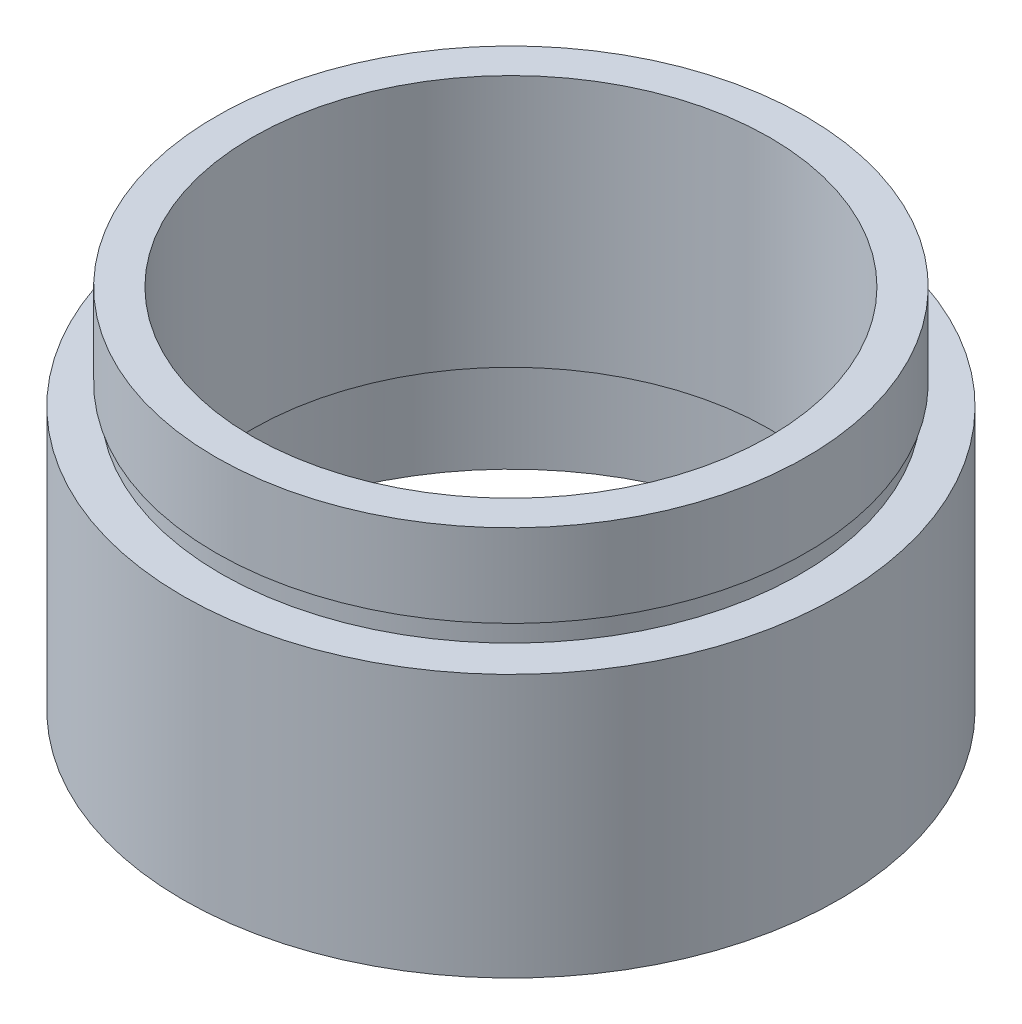
ISO-10303-21;
HEADER;
FILE_DESCRIPTION(('STEP AP214'),'2;1');
FILE_NAME('part.step','',(''),(''),'','','');
FILE_SCHEMA(('AUTOMOTIVE_DESIGN { 1 0 10303 214 1 1 1 1 }'));
ENDSEC;
DATA;
#1=APPLICATION_CONTEXT('core data for automotive mechanical design processes');
#2=APPLICATION_PROTOCOL_DEFINITION('international standard','automotive_design',2000,#1);
#3=PRODUCT_CONTEXT('',#1,'mechanical');
#4=PRODUCT('Part','Part','',(#3));
#5=PRODUCT_RELATED_PRODUCT_CATEGORY('part','',(#4));
#6=PRODUCT_DEFINITION_FORMATION('','',#4);
#7=PRODUCT_DEFINITION_CONTEXT('part definition',#1,'design');
#8=PRODUCT_DEFINITION('design','',#6,#7);
#9=PRODUCT_DEFINITION_SHAPE('','',#8);
#10=(LENGTH_UNIT() NAMED_UNIT(*) SI_UNIT(.MILLI.,.METRE.));
#11=(NAMED_UNIT(*) PLANE_ANGLE_UNIT() SI_UNIT($,.RADIAN.));
#12=(NAMED_UNIT(*) SI_UNIT($,.STERADIAN.) SOLID_ANGLE_UNIT());
#13=UNCERTAINTY_MEASURE_WITH_UNIT(LENGTH_MEASURE(1.E-05),#10,'distance_accuracy_value','');
#14=(GEOMETRIC_REPRESENTATION_CONTEXT(3) GLOBAL_UNCERTAINTY_ASSIGNED_CONTEXT((#13)) GLOBAL_UNIT_ASSIGNED_CONTEXT((#10,
#11,#12)) REPRESENTATION_CONTEXT('',''));
#15=CARTESIAN_POINT('',(0.,0.,0.));
#16=DIRECTION('',(0.,0.,1.));
#17=DIRECTION('',(1.,0.,0.));
#18=AXIS2_PLACEMENT_3D('',#15,#16,#17);
#19=CARTESIAN_POINT('',(14.25,0.,0.));
#20=DIRECTION('',(0.,1.,0.));
#21=DIRECTION('',(0.,0.,1.));
#22=AXIS2_PLACEMENT_3D('',#19,#20,#21);
#23=PLANE('',#22);
#24=CARTESIAN_POINT('',(0.,0.,0.));
#25=DIRECTION('',(0.,1.,0.));
#26=DIRECTION('',(0.,0.,1.));
#27=AXIS2_PLACEMENT_3D('',#24,#25,#26);
#28=CIRCLE('',#27,15.85);
#29=CARTESIAN_POINT('',(0.,0.,15.85));
#30=VERTEX_POINT('',#29);
#31=EDGE_CURVE('E10',#30,#30,#28,.T.);
#32=ORIENTED_EDGE('',*,*,#31,.F.);
#33=EDGE_LOOP('',(#32));
#34=FACE_BOUND('',#33,.T.);
#35=CARTESIAN_POINT('',(0.,0.,0.));
#36=DIRECTION('',(0.,1.,0.));
#37=DIRECTION('',(0.,0.,1.));
#38=AXIS2_PLACEMENT_3D('',#35,#36,#37);
#39=CIRCLE('',#38,14.25);
#40=CARTESIAN_POINT('',(0.,0.,14.25));
#41=VERTEX_POINT('',#40);
#42=EDGE_CURVE('E77',#41,#41,#39,.T.);
#43=ORIENTED_EDGE('',*,*,#42,.T.);
#44=EDGE_LOOP('',(#43));
#45=FACE_BOUND('',#44,.T.);
#46=ADVANCED_FACE('F37',(#34,#45),#23,.F.);
#47=CARTESIAN_POINT('',(0.,161.376166943427,0.));
#48=DIRECTION('',(0.,1.,0.));
#49=DIRECTION('',(0.,0.,1.));
#50=AXIS2_PLACEMENT_3D('',#47,#48,#49);
#51=CYLINDRICAL_SURFACE('',#50,15.85);
#52=CARTESIAN_POINT('',(0.,12.7,0.));
#53=DIRECTION('',(0.,1.,0.));
#54=DIRECTION('',(0.,0.,1.));
#55=AXIS2_PLACEMENT_3D('',#52,#53,#54);
#56=CIRCLE('',#55,15.85);
#57=CARTESIAN_POINT('',(0.,12.7,15.85));
#58=VERTEX_POINT('',#57);
#59=EDGE_CURVE('E43',#58,#58,#56,.T.);
#60=ORIENTED_EDGE('',*,*,#59,.F.);
#61=EDGE_LOOP('',(#60));
#62=FACE_BOUND('',#61,.T.);
#63=ORIENTED_EDGE('',*,*,#31,.T.);
#64=EDGE_LOOP('',(#63));
#65=FACE_BOUND('',#64,.T.);
#66=ADVANCED_FACE('F138',(#62,#65),#51,.T.);
#67=CARTESIAN_POINT('',(14.,12.7,0.));
#68=DIRECTION('',(0.,-1.,0.));
#69=DIRECTION('',(0.,0.,-1.));
#70=AXIS2_PLACEMENT_3D('',#67,#68,#69);
#71=PLANE('',#70);
#72=CARTESIAN_POINT('',(0.,12.7,0.));
#73=DIRECTION('',(0.,1.,0.));
#74=DIRECTION('',(0.,0.,1.));
#75=AXIS2_PLACEMENT_3D('',#72,#73,#74);
#76=CIRCLE('',#75,14.);
#77=CARTESIAN_POINT('',(0.,12.7,14.));
#78=VERTEX_POINT('',#77);
#79=EDGE_CURVE('E47',#78,#78,#76,.T.);
#80=ORIENTED_EDGE('',*,*,#79,.F.);
#81=EDGE_LOOP('',(#80));
#82=FACE_BOUND('',#81,.T.);
#83=ORIENTED_EDGE('',*,*,#59,.T.);
#84=EDGE_LOOP('',(#83));
#85=FACE_BOUND('',#84,.T.);
#86=ADVANCED_FACE('F133',(#82,#85),#71,.F.);
#87=CARTESIAN_POINT('',(0.,161.376166943427,0.));
#88=DIRECTION('',(0.,1.,0.));
#89=DIRECTION('',(0.,0.,1.));
#90=AXIS2_PLACEMENT_3D('',#87,#88,#89);
#91=CYLINDRICAL_SURFACE('',#90,14.);
#92=CARTESIAN_POINT('',(0.,13.7,0.));
#93=DIRECTION('',(0.,1.,0.));
#94=DIRECTION('',(0.,0.,1.));
#95=AXIS2_PLACEMENT_3D('',#92,#93,#94);
#96=CIRCLE('',#95,14.);
#97=CARTESIAN_POINT('',(0.,13.7,14.));
#98=VERTEX_POINT('',#97);
#99=EDGE_CURVE('E51',#98,#98,#96,.T.);
#100=ORIENTED_EDGE('',*,*,#99,.F.);
#101=EDGE_LOOP('',(#100));
#102=FACE_BOUND('',#101,.T.);
#103=ORIENTED_EDGE('',*,*,#79,.T.);
#104=EDGE_LOOP('',(#103));
#105=FACE_BOUND('',#104,.T.);
#106=ADVANCED_FACE('F127',(#102,#105),#91,.T.);
#107=CARTESIAN_POINT('',(14.,13.7,0.));
#108=DIRECTION('',(0.,1.,0.));
#109=DIRECTION('',(0.,0.,1.));
#110=AXIS2_PLACEMENT_3D('',#107,#108,#109);
#111=PLANE('',#110);
#112=CARTESIAN_POINT('',(0.,13.7,0.));
#113=DIRECTION('',(0.,1.,0.));
#114=DIRECTION('',(0.,0.,1.));
#115=AXIS2_PLACEMENT_3D('',#112,#113,#114);
#116=CIRCLE('',#115,14.25);
#117=CARTESIAN_POINT('',(0.,13.7,14.25));
#118=VERTEX_POINT('',#117);
#119=EDGE_CURVE('E56',#118,#118,#116,.T.);
#120=ORIENTED_EDGE('',*,*,#119,.F.);
#121=EDGE_LOOP('',(#120));
#122=FACE_BOUND('',#121,.T.);
#123=ORIENTED_EDGE('',*,*,#99,.T.);
#124=EDGE_LOOP('',(#123));
#125=FACE_BOUND('',#124,.T.);
#126=ADVANCED_FACE('F121',(#122,#125),#111,.F.);
#127=CARTESIAN_POINT('',(0.,161.376166943427,0.));
#128=DIRECTION('',(0.,1.,0.));
#129=DIRECTION('',(0.,0.,1.));
#130=AXIS2_PLACEMENT_3D('',#127,#128,#129);
#131=CYLINDRICAL_SURFACE('',#130,14.25);
#132=CARTESIAN_POINT('',(0.,17.7,0.));
#133=DIRECTION('',(0.,1.,0.));
#134=DIRECTION('',(0.,0.,1.));
#135=AXIS2_PLACEMENT_3D('',#132,#133,#134);
#136=CIRCLE('',#135,14.25);
#137=CARTESIAN_POINT('',(0.,17.7,14.25));
#138=VERTEX_POINT('',#137);
#139=EDGE_CURVE('E59',#138,#138,#136,.T.);
#140=ORIENTED_EDGE('',*,*,#139,.F.);
#141=EDGE_LOOP('',(#140));
#142=FACE_BOUND('',#141,.T.);
#143=ORIENTED_EDGE('',*,*,#119,.T.);
#144=EDGE_LOOP('',(#143));
#145=FACE_BOUND('',#144,.T.);
#146=ADVANCED_FACE('F115',(#142,#145),#131,.T.);
#147=CARTESIAN_POINT('',(12.5,17.7,0.));
#148=DIRECTION('',(0.,-1.,0.));
#149=DIRECTION('',(0.,0.,-1.));
#150=AXIS2_PLACEMENT_3D('',#147,#148,#149);
#151=PLANE('',#150);
#152=CARTESIAN_POINT('',(0.,17.7,0.));
#153=DIRECTION('',(0.,1.,0.));
#154=DIRECTION('',(0.,0.,1.));
#155=AXIS2_PLACEMENT_3D('',#152,#153,#154);
#156=CIRCLE('',#155,12.5);
#157=CARTESIAN_POINT('',(0.,17.7,12.5));
#158=VERTEX_POINT('',#157);
#159=EDGE_CURVE('E62',#158,#158,#156,.T.);
#160=ORIENTED_EDGE('',*,*,#159,.F.);
#161=EDGE_LOOP('',(#160));
#162=FACE_BOUND('',#161,.T.);
#163=ORIENTED_EDGE('',*,*,#139,.T.);
#164=EDGE_LOOP('',(#163));
#165=FACE_BOUND('',#164,.T.);
#166=ADVANCED_FACE('F109',(#162,#165),#151,.F.);
#167=CARTESIAN_POINT('',(0.,161.376166943427,0.));
#168=DIRECTION('',(0.,1.,0.));
#169=DIRECTION('',(0.,0.,1.));
#170=AXIS2_PLACEMENT_3D('',#167,#168,#169);
#171=CYLINDRICAL_SURFACE('',#170,12.5);
#172=CARTESIAN_POINT('',(0.,5.49999999999998,0.));
#173=DIRECTION('',(0.,1.,0.));
#174=DIRECTION('',(0.,0.,1.));
#175=AXIS2_PLACEMENT_3D('',#172,#173,#174);
#176=CIRCLE('',#175,12.5);
#177=CARTESIAN_POINT('',(0.,5.49999999999998,12.5));
#178=VERTEX_POINT('',#177);
#179=EDGE_CURVE('E65',#178,#178,#176,.T.);
#180=ORIENTED_EDGE('',*,*,#179,.F.);
#181=EDGE_LOOP('',(#180));
#182=FACE_BOUND('',#181,.T.);
#183=ORIENTED_EDGE('',*,*,#159,.T.);
#184=EDGE_LOOP('',(#183));
#185=FACE_BOUND('',#184,.T.);
#186=ADVANCED_FACE('F103',(#182,#185),#171,.F.);
#187=CARTESIAN_POINT('',(12.5,5.49999999999998,0.));
#188=DIRECTION('',(0.,1.,0.));
#189=DIRECTION('',(0.,0.,1.));
#190=AXIS2_PLACEMENT_3D('',#187,#188,#189);
#191=PLANE('',#190);
#192=CARTESIAN_POINT('',(0.,5.49999999999998,0.));
#193=DIRECTION('',(0.,1.,0.));
#194=DIRECTION('',(0.,0.,1.));
#195=AXIS2_PLACEMENT_3D('',#192,#193,#194);
#196=CIRCLE('',#195,14.35);
#197=CARTESIAN_POINT('',(0.,5.49999999999998,14.35));
#198=VERTEX_POINT('',#197);
#199=EDGE_CURVE('E68',#198,#198,#196,.T.);
#200=ORIENTED_EDGE('',*,*,#199,.F.);
#201=EDGE_LOOP('',(#200));
#202=FACE_BOUND('',#201,.T.);
#203=ORIENTED_EDGE('',*,*,#179,.T.);
#204=EDGE_LOOP('',(#203));
#205=FACE_BOUND('',#204,.T.);
#206=ADVANCED_FACE('F97',(#202,#205),#191,.F.);
#207=CARTESIAN_POINT('',(0.,161.376166943427,0.));
#208=DIRECTION('',(0.,1.,0.));
#209=DIRECTION('',(0.,0.,1.));
#210=AXIS2_PLACEMENT_3D('',#207,#208,#209);
#211=CYLINDRICAL_SURFACE('',#210,14.35);
#212=CARTESIAN_POINT('',(0.,4.49999999999998,0.));
#213=DIRECTION('',(0.,1.,0.));
#214=DIRECTION('',(0.,0.,1.));
#215=AXIS2_PLACEMENT_3D('',#212,#213,#214);
#216=CIRCLE('',#215,14.35);
#217=CARTESIAN_POINT('',(0.,4.49999999999998,14.35));
#218=VERTEX_POINT('',#217);
#219=EDGE_CURVE('E71',#218,#218,#216,.T.);
#220=ORIENTED_EDGE('',*,*,#219,.F.);
#221=EDGE_LOOP('',(#220));
#222=FACE_BOUND('',#221,.T.);
#223=ORIENTED_EDGE('',*,*,#199,.T.);
#224=EDGE_LOOP('',(#223));
#225=FACE_BOUND('',#224,.T.);
#226=ADVANCED_FACE('F91',(#222,#225),#211,.F.);
#227=CARTESIAN_POINT('',(14.25,4.50000000000001,0.));
#228=DIRECTION('',(0.,-1.,0.));
#229=DIRECTION('',(0.,0.,-1.));
#230=AXIS2_PLACEMENT_3D('',#227,#228,#229);
#231=PLANE('',#230);
#232=CARTESIAN_POINT('',(0.,4.50000000000003,0.));
#233=DIRECTION('',(0.,1.,0.));
#234=DIRECTION('',(0.,0.,1.));
#235=AXIS2_PLACEMENT_3D('',#232,#233,#234);
#236=CIRCLE('',#235,14.25);
#237=CARTESIAN_POINT('',(0.,4.50000000000003,14.25));
#238=VERTEX_POINT('',#237);
#239=EDGE_CURVE('E74',#238,#238,#236,.T.);
#240=ORIENTED_EDGE('',*,*,#239,.F.);
#241=EDGE_LOOP('',(#240));
#242=FACE_BOUND('',#241,.T.);
#243=ORIENTED_EDGE('',*,*,#219,.T.);
#244=EDGE_LOOP('',(#243));
#245=FACE_BOUND('',#244,.T.);
#246=ADVANCED_FACE('F85',(#242,#245),#231,.F.);
#247=CARTESIAN_POINT('',(0.,161.376166943427,0.));
#248=DIRECTION('',(0.,1.,0.));
#249=DIRECTION('',(0.,0.,1.));
#250=AXIS2_PLACEMENT_3D('',#247,#248,#249);
#251=CYLINDRICAL_SURFACE('',#250,14.25);
#252=ORIENTED_EDGE('',*,*,#42,.F.);
#253=EDGE_LOOP('',(#252));
#254=FACE_BOUND('',#253,.T.);
#255=ORIENTED_EDGE('',*,*,#239,.T.);
#256=EDGE_LOOP('',(#255));
#257=FACE_BOUND('',#256,.T.);
#258=ADVANCED_FACE('F82',(#254,#257),#251,.F.);
#259=CLOSED_SHELL('',(#46,#66,#86,#106,#126,#146,#166,#186,#206,#226,#246,#258));
#260=MANIFOLD_SOLID_BREP('B2',#259);
#261=ADVANCED_BREP_SHAPE_REPRESENTATION('',(#18,#260),#14);
#262=SHAPE_DEFINITION_REPRESENTATION(#9,#261);
ENDSEC;
END-ISO-10303-21;
